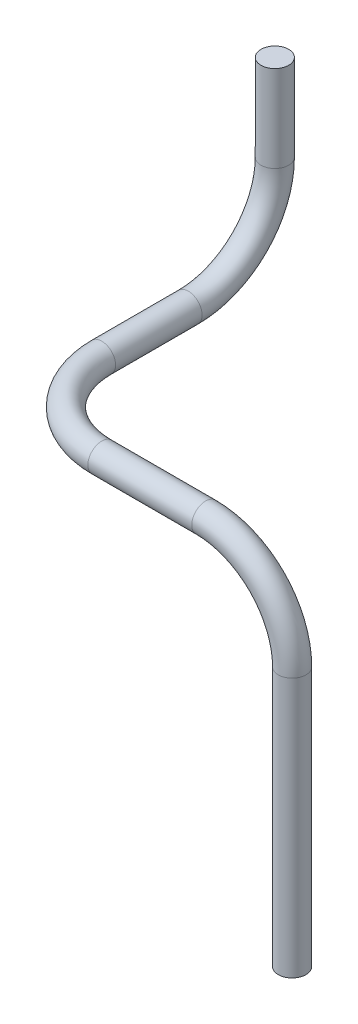
ISO-10303-21;
HEADER;
FILE_DESCRIPTION(('STEP AP214'),'2;1');
FILE_NAME('part.step','',(''),(''),'','','');
FILE_SCHEMA(('AUTOMOTIVE_DESIGN { 1 0 10303 214 1 1 1 1 }'));
ENDSEC;
DATA;
#1=APPLICATION_CONTEXT('core data for automotive mechanical design processes');
#2=APPLICATION_PROTOCOL_DEFINITION('international standard','automotive_design',2000,#1);
#3=PRODUCT_CONTEXT('',#1,'mechanical');
#4=PRODUCT('Part','Part','',(#3));
#5=PRODUCT_RELATED_PRODUCT_CATEGORY('part','',(#4));
#6=PRODUCT_DEFINITION_FORMATION('','',#4);
#7=PRODUCT_DEFINITION_CONTEXT('part definition',#1,'design');
#8=PRODUCT_DEFINITION('design','',#6,#7);
#9=PRODUCT_DEFINITION_SHAPE('','',#8);
#10=(LENGTH_UNIT() NAMED_UNIT(*) SI_UNIT(.MILLI.,.METRE.));
#11=(NAMED_UNIT(*) PLANE_ANGLE_UNIT() SI_UNIT($,.RADIAN.));
#12=(NAMED_UNIT(*) SI_UNIT($,.STERADIAN.) SOLID_ANGLE_UNIT());
#13=UNCERTAINTY_MEASURE_WITH_UNIT(LENGTH_MEASURE(1.E-05),#10,'distance_accuracy_value','');
#14=(GEOMETRIC_REPRESENTATION_CONTEXT(3) GLOBAL_UNCERTAINTY_ASSIGNED_CONTEXT((#13)) GLOBAL_UNIT_ASSIGNED_CONTEXT((#10,
#11,#12)) REPRESENTATION_CONTEXT('',''));
#15=CARTESIAN_POINT('',(0.,0.,0.));
#16=DIRECTION('',(0.,0.,1.));
#17=DIRECTION('',(1.,0.,0.));
#18=AXIS2_PLACEMENT_3D('',#15,#16,#17);
#19=CARTESIAN_POINT('',(0.,0.,0.));
#20=DIRECTION('',(0.,1.,0.));
#21=DIRECTION('',(0.,0.,1.));
#22=AXIS2_PLACEMENT_3D('',#19,#20,#21);
#23=PLANE('',#22);
#24=CARTESIAN_POINT('',(0.,0.,0.));
#25=DIRECTION('',(0.,1.,0.));
#26=DIRECTION('',(0.,0.,1.));
#27=AXIS2_PLACEMENT_3D('',#24,#25,#26);
#28=CIRCLE('',#27,0.8);
#29=CARTESIAN_POINT('',(0.,0.,0.8));
#30=VERTEX_POINT('',#29);
#31=EDGE_CURVE('E59',#30,#30,#28,.T.);
#32=ORIENTED_EDGE('',*,*,#31,.T.);
#33=EDGE_LOOP('',(#32));
#34=FACE_BOUND('',#33,.T.);
#35=ADVANCED_FACE('F31',(#34),#23,.T.);
#36=CARTESIAN_POINT('',(16.,-30.,15.));
#37=DIRECTION('',(0.,1.,0.));
#38=DIRECTION('',(1.,0.,0.));
#39=AXIS2_PLACEMENT_3D('',#36,#37,#38);
#40=PLANE('',#39);
#41=CARTESIAN_POINT('',(16.,-30.,15.));
#42=DIRECTION('',(0.,1.,0.));
#43=DIRECTION('',(1.,0.,0.));
#44=AXIS2_PLACEMENT_3D('',#41,#42,#43);
#45=CIRCLE('',#44,0.8);
#46=CARTESIAN_POINT('',(16.8,-30.,15.));
#47=VERTEX_POINT('',#46);
#48=EDGE_CURVE('E10',#47,#47,#45,.T.);
#49=ORIENTED_EDGE('',*,*,#48,.F.);
#50=EDGE_LOOP('',(#49));
#51=FACE_BOUND('',#50,.T.);
#52=ADVANCED_FACE('F67',(#51),#40,.F.);
#53=CARTESIAN_POINT('',(0.,0.,0.));
#54=DIRECTION('',(0.,-1.,0.));
#55=DIRECTION('',(0.,0.,-1.));
#56=AXIS2_PLACEMENT_3D('',#53,#54,#55);
#57=CYLINDRICAL_SURFACE('',#56,0.8);
#58=CARTESIAN_POINT('',(0.,-5.,0.));
#59=DIRECTION('',(0.,1.,0.));
#60=DIRECTION('',(0.,0.,1.));
#61=AXIS2_PLACEMENT_3D('',#58,#59,#60);
#62=CIRCLE('',#61,0.8);
#63=CARTESIAN_POINT('',(0.,-5.,-0.800000000000001));
#64=VERTEX_POINT('',#63);
#65=EDGE_CURVE('E56',#64,#64,#62,.T.);
#66=ORIENTED_EDGE('',*,*,#65,.T.);
#67=EDGE_LOOP('',(#66));
#68=FACE_BOUND('',#67,.T.);
#69=ORIENTED_EDGE('',*,*,#31,.F.);
#70=EDGE_LOOP('',(#69));
#71=FACE_BOUND('',#70,.T.);
#72=ADVANCED_FACE('F64',(#68,#71),#57,.T.);
#73=CARTESIAN_POINT('',(0.,-5.,5.));
#74=DIRECTION('',(-1.,0.,0.));
#75=DIRECTION('',(0.,0.,1.));
#76=AXIS2_PLACEMENT_3D('',#73,#74,#75);
#77=TOROIDAL_SURFACE('',#76,5.,0.8);
#78=CARTESIAN_POINT('',(0.,-10.,5.));
#79=DIRECTION('',(0.,0.,-1.));
#80=DIRECTION('',(0.,1.,0.));
#81=AXIS2_PLACEMENT_3D('',#78,#79,#80);
#82=CIRCLE('',#81,0.8);
#83=CARTESIAN_POINT('',(0.,-10.8,5.));
#84=VERTEX_POINT('',#83);
#85=EDGE_CURVE('E53',#84,#84,#82,.T.);
#86=CARTESIAN_POINT('',(0.,-5.,5.));
#87=DIRECTION('',(-1.,0.,0.));
#88=DIRECTION('',(0.,0.,1.));
#89=AXIS2_PLACEMENT_3D('',#86,#87,#88);
#90=CIRCLE('',#89,5.8);
#91=EDGE_CURVE('',#64,#84,#90,.T.);
#92=ORIENTED_EDGE('',*,*,#65,.F.);
#93=ORIENTED_EDGE('',*,*,#85,.T.);
#94=ORIENTED_EDGE('',*,*,#91,.T.);
#95=ORIENTED_EDGE('',*,*,#91,.F.);
#96=EDGE_LOOP('',(#92,#94,#93,#95));
#97=FACE_BOUND('',#96,.T.);
#98=ADVANCED_FACE('F66',(#97),#77,.T.);
#99=CARTESIAN_POINT('',(0.,-10.,5.));
#100=DIRECTION('',(0.,0.,1.));
#101=DIRECTION('',(1.,0.,0.));
#102=AXIS2_PLACEMENT_3D('',#99,#100,#101);
#103=CYLINDRICAL_SURFACE('',#102,0.8);
#104=CARTESIAN_POINT('',(0.,-10.,10.));
#105=DIRECTION('',(0.,0.,-1.));
#106=DIRECTION('',(0.,1.,0.));
#107=AXIS2_PLACEMENT_3D('',#104,#105,#106);
#108=CIRCLE('',#107,0.8);
#109=CARTESIAN_POINT('',(-0.8,-10.,10.));
#110=VERTEX_POINT('',#109);
#111=EDGE_CURVE('E50',#110,#110,#108,.T.);
#112=ORIENTED_EDGE('',*,*,#111,.T.);
#113=EDGE_LOOP('',(#112));
#114=FACE_BOUND('',#113,.T.);
#115=ORIENTED_EDGE('',*,*,#85,.F.);
#116=EDGE_LOOP('',(#115));
#117=FACE_BOUND('',#116,.T.);
#118=ADVANCED_FACE('F74',(#114,#117),#103,.T.);
#119=CARTESIAN_POINT('',(5.,-10.,10.));
#120=DIRECTION('',(0.,1.,0.));
#121=DIRECTION('',(0.,0.,1.));
#122=AXIS2_PLACEMENT_3D('',#119,#120,#121);
#123=TOROIDAL_SURFACE('',#122,5.,0.8);
#124=CARTESIAN_POINT('',(5.,-10.,15.));
#125=DIRECTION('',(-1.,0.,0.));
#126=DIRECTION('',(0.,1.,0.));
#127=AXIS2_PLACEMENT_3D('',#124,#125,#126);
#128=CIRCLE('',#127,0.8);
#129=CARTESIAN_POINT('',(5.,-10.,15.8));
#130=VERTEX_POINT('',#129);
#131=EDGE_CURVE('E45',#130,#130,#128,.T.);
#132=CARTESIAN_POINT('',(5.,-10.,10.));
#133=DIRECTION('',(0.,1.,0.));
#134=DIRECTION('',(0.,0.,1.));
#135=AXIS2_PLACEMENT_3D('',#132,#133,#134);
#136=CIRCLE('',#135,5.8);
#137=EDGE_CURVE('',#110,#130,#136,.T.);
#138=ORIENTED_EDGE('',*,*,#111,.F.);
#139=ORIENTED_EDGE('',*,*,#131,.T.);
#140=ORIENTED_EDGE('',*,*,#137,.T.);
#141=ORIENTED_EDGE('',*,*,#137,.F.);
#142=EDGE_LOOP('',(#138,#140,#139,#141));
#143=FACE_BOUND('',#142,.T.);
#144=ADVANCED_FACE('F91',(#143),#123,.T.);
#145=CARTESIAN_POINT('',(5.,-10.,15.));
#146=DIRECTION('',(1.,0.,0.));
#147=DIRECTION('',(0.,0.,-1.));
#148=AXIS2_PLACEMENT_3D('',#145,#146,#147);
#149=CYLINDRICAL_SURFACE('',#148,0.8);
#150=CARTESIAN_POINT('',(11.,-10.,15.));
#151=DIRECTION('',(-1.,0.,0.));
#152=DIRECTION('',(0.,1.,0.));
#153=AXIS2_PLACEMENT_3D('',#150,#151,#152);
#154=CIRCLE('',#153,0.8);
#155=CARTESIAN_POINT('',(11.,-9.2,15.));
#156=VERTEX_POINT('',#155);
#157=EDGE_CURVE('E41',#156,#156,#154,.T.);
#158=ORIENTED_EDGE('',*,*,#157,.T.);
#159=EDGE_LOOP('',(#158));
#160=FACE_BOUND('',#159,.T.);
#161=ORIENTED_EDGE('',*,*,#131,.F.);
#162=EDGE_LOOP('',(#161));
#163=FACE_BOUND('',#162,.T.);
#164=ADVANCED_FACE('F85',(#160,#163),#149,.T.);
#165=CARTESIAN_POINT('',(11.,-15.,15.));
#166=DIRECTION('',(0.,0.,-1.));
#167=DIRECTION('',(-1.,0.,0.));
#168=AXIS2_PLACEMENT_3D('',#165,#166,#167);
#169=TOROIDAL_SURFACE('',#168,5.,0.8);
#170=CARTESIAN_POINT('',(16.,-15.,15.));
#171=DIRECTION('',(0.,1.,0.));
#172=DIRECTION('',(1.,0.,0.));
#173=AXIS2_PLACEMENT_3D('',#170,#171,#172);
#174=CIRCLE('',#173,0.8);
#175=CARTESIAN_POINT('',(16.8,-15.,15.));
#176=VERTEX_POINT('',#175);
#177=EDGE_CURVE('E37',#176,#176,#174,.T.);
#178=CARTESIAN_POINT('',(11.,-15.,15.));
#179=DIRECTION('',(0.,0.,-1.));
#180=DIRECTION('',(-1.,0.,0.));
#181=AXIS2_PLACEMENT_3D('',#178,#179,#180);
#182=CIRCLE('',#181,5.8);
#183=EDGE_CURVE('',#156,#176,#182,.T.);
#184=ORIENTED_EDGE('',*,*,#157,.F.);
#185=ORIENTED_EDGE('',*,*,#177,.T.);
#186=ORIENTED_EDGE('',*,*,#183,.T.);
#187=ORIENTED_EDGE('',*,*,#183,.F.);
#188=EDGE_LOOP('',(#184,#186,#185,#187));
#189=FACE_BOUND('',#188,.T.);
#190=ADVANCED_FACE('F80',(#189),#169,.T.);
#191=CARTESIAN_POINT('',(16.,-15.,15.));
#192=DIRECTION('',(0.,-1.,0.));
#193=DIRECTION('',(1.,0.,0.));
#194=AXIS2_PLACEMENT_3D('',#191,#192,#193);
#195=CYLINDRICAL_SURFACE('',#194,0.8);
#196=ORIENTED_EDGE('',*,*,#48,.T.);
#197=EDGE_LOOP('',(#196));
#198=FACE_BOUND('',#197,.T.);
#199=ORIENTED_EDGE('',*,*,#177,.F.);
#200=EDGE_LOOP('',(#199));
#201=FACE_BOUND('',#200,.T.);
#202=ADVANCED_FACE('F78',(#198,#201),#195,.T.);
#203=CLOSED_SHELL('',(#35,#52,#72,#98,#118,#144,#164,#190,#202));
#204=MANIFOLD_SOLID_BREP('B2',#203);
#205=ADVANCED_BREP_SHAPE_REPRESENTATION('',(#18,#204),#14);
#206=SHAPE_DEFINITION_REPRESENTATION(#9,#205);
ENDSEC;
END-ISO-10303-21;
